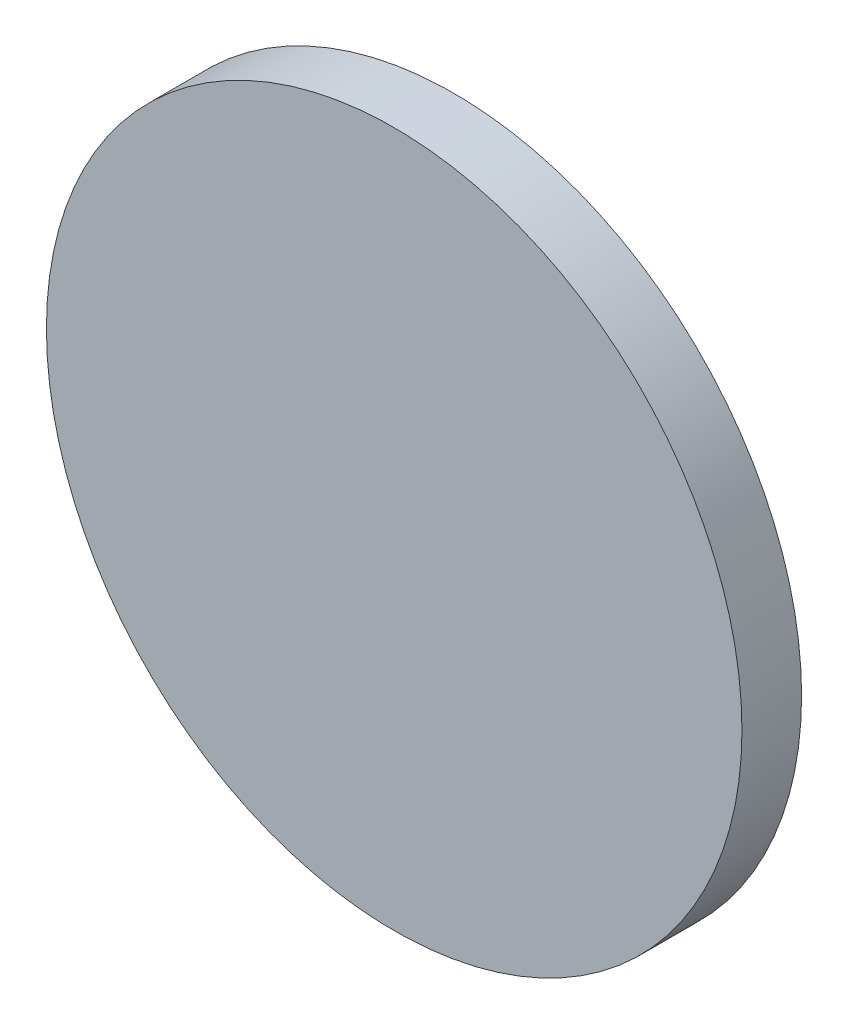
ISO-10303-21;
HEADER;
FILE_DESCRIPTION(('STEP AP214'),'2;1');
FILE_NAME('part.step','',(''),(''),'','','');
FILE_SCHEMA(('AUTOMOTIVE_DESIGN { 1 0 10303 214 1 1 1 1 }'));
ENDSEC;
DATA;
#1=APPLICATION_CONTEXT('core data for automotive mechanical design processes');
#2=APPLICATION_PROTOCOL_DEFINITION('international standard','automotive_design',2000,#1);
#3=PRODUCT_CONTEXT('',#1,'mechanical');
#4=PRODUCT('Part','Part','',(#3));
#5=PRODUCT_RELATED_PRODUCT_CATEGORY('part','',(#4));
#6=PRODUCT_DEFINITION_FORMATION('','',#4);
#7=PRODUCT_DEFINITION_CONTEXT('part definition',#1,'design');
#8=PRODUCT_DEFINITION('design','',#6,#7);
#9=PRODUCT_DEFINITION_SHAPE('','',#8);
#10=(LENGTH_UNIT() NAMED_UNIT(*) SI_UNIT(.MILLI.,.METRE.));
#11=(NAMED_UNIT(*) PLANE_ANGLE_UNIT() SI_UNIT($,.RADIAN.));
#12=(NAMED_UNIT(*) SI_UNIT($,.STERADIAN.) SOLID_ANGLE_UNIT());
#13=UNCERTAINTY_MEASURE_WITH_UNIT(LENGTH_MEASURE(1.E-05),#10,'distance_accuracy_value','');
#14=(GEOMETRIC_REPRESENTATION_CONTEXT(3) GLOBAL_UNCERTAINTY_ASSIGNED_CONTEXT((#13)) GLOBAL_UNIT_ASSIGNED_CONTEXT((#10,
#11,#12)) REPRESENTATION_CONTEXT('',''));
#15=CARTESIAN_POINT('',(0.,0.,0.));
#16=DIRECTION('',(0.,0.,1.));
#17=DIRECTION('',(1.,0.,0.));
#18=AXIS2_PLACEMENT_3D('',#15,#16,#17);
#19=CARTESIAN_POINT('',(5.739,6.5,0.));
#20=DIRECTION('',(0.,0.,-1.));
#21=DIRECTION('',(-1.,0.,0.));
#22=AXIS2_PLACEMENT_3D('',#19,#20,#21);
#23=PLANE('',#22);
#24=CARTESIAN_POINT('',(5.739,6.5,0.));
#25=DIRECTION('',(0.,0.,1.));
#26=DIRECTION('',(1.,0.,0.));
#27=AXIS2_PLACEMENT_3D('',#24,#25,#26);
#28=CIRCLE('',#27,0.200024667);
#29=CARTESIAN_POINT('',(5.939024667,6.5,0.));
#30=VERTEX_POINT('',#29);
#31=EDGE_CURVE('E18',#30,#30,#28,.T.);
#32=ORIENTED_EDGE('',*,*,#31,.F.);
#33=EDGE_LOOP('',(#32));
#34=FACE_BOUND('',#33,.T.);
#35=ADVANCED_FACE('F15',(#34),#23,.T.);
#36=CARTESIAN_POINT('',(5.739,6.5,0.));
#37=DIRECTION('',(0.,0.,1.));
#38=DIRECTION('',(1.,0.,0.));
#39=AXIS2_PLACEMENT_3D('',#36,#37,#38);
#40=CYLINDRICAL_SURFACE('',#39,0.200024667);
#41=CARTESIAN_POINT('',(5.739,6.5,0.03429));
#42=DIRECTION('',(0.,0.,1.));
#43=DIRECTION('',(1.,0.,0.));
#44=AXIS2_PLACEMENT_3D('',#41,#42,#43);
#45=CIRCLE('',#44,0.200024667);
#46=CARTESIAN_POINT('',(5.939024667,6.5,0.03429));
#47=VERTEX_POINT('',#46);
#48=EDGE_CURVE('E10',#47,#47,#45,.T.);
#49=ORIENTED_EDGE('',*,*,#48,.F.);
#50=EDGE_LOOP('',(#49));
#51=FACE_BOUND('',#50,.T.);
#52=ORIENTED_EDGE('',*,*,#31,.T.);
#53=EDGE_LOOP('',(#52));
#54=FACE_BOUND('',#53,.T.);
#55=ADVANCED_FACE('F27',(#51,#54),#40,.T.);
#56=CARTESIAN_POINT('',(5.739,6.5,0.03429));
#57=DIRECTION('',(0.,0.,1.));
#58=DIRECTION('',(1.,0.,0.));
#59=AXIS2_PLACEMENT_3D('',#56,#57,#58);
#60=PLANE('',#59);
#61=ORIENTED_EDGE('',*,*,#48,.T.);
#62=EDGE_LOOP('',(#61));
#63=FACE_BOUND('',#62,.T.);
#64=ADVANCED_FACE('F34',(#63),#60,.T.);
#65=CLOSED_SHELL('',(#35,#55,#64));
#66=MANIFOLD_SOLID_BREP('B1',#65);
#67=ADVANCED_BREP_SHAPE_REPRESENTATION('',(#18,#66),#14);
#68=SHAPE_DEFINITION_REPRESENTATION(#9,#67);
ENDSEC;
END-ISO-10303-21;
